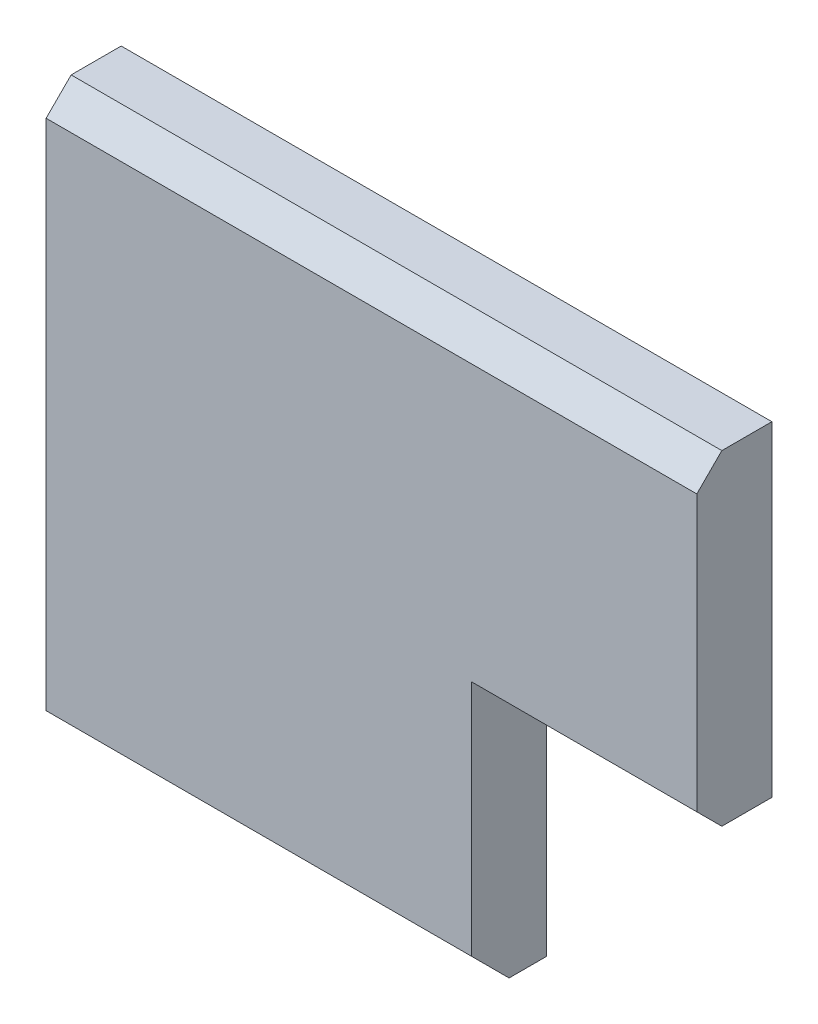
ISO-10303-21;
HEADER;
FILE_DESCRIPTION(('STEP AP214'),'2;1');
FILE_NAME('part.step','',(''),(''),'','','');
FILE_SCHEMA(('AUTOMOTIVE_DESIGN { 1 0 10303 214 1 1 1 1 }'));
ENDSEC;
DATA;
#1=APPLICATION_CONTEXT('core data for automotive mechanical design processes');
#2=APPLICATION_PROTOCOL_DEFINITION('international standard','automotive_design',2000,#1);
#3=PRODUCT_CONTEXT('',#1,'mechanical');
#4=PRODUCT('Part','Part','',(#3));
#5=PRODUCT_RELATED_PRODUCT_CATEGORY('part','',(#4));
#6=PRODUCT_DEFINITION_FORMATION('','',#4);
#7=PRODUCT_DEFINITION_CONTEXT('part definition',#1,'design');
#8=PRODUCT_DEFINITION('design','',#6,#7);
#9=PRODUCT_DEFINITION_SHAPE('','',#8);
#10=(LENGTH_UNIT() NAMED_UNIT(*) SI_UNIT(.MILLI.,.METRE.));
#11=(NAMED_UNIT(*) PLANE_ANGLE_UNIT() SI_UNIT($,.RADIAN.));
#12=(NAMED_UNIT(*) SI_UNIT($,.STERADIAN.) SOLID_ANGLE_UNIT());
#13=UNCERTAINTY_MEASURE_WITH_UNIT(LENGTH_MEASURE(1.E-05),#10,'distance_accuracy_value','');
#14=(GEOMETRIC_REPRESENTATION_CONTEXT(3) GLOBAL_UNCERTAINTY_ASSIGNED_CONTEXT((#13)) GLOBAL_UNIT_ASSIGNED_CONTEXT((#10,
#11,#12)) REPRESENTATION_CONTEXT('',''));
#15=CARTESIAN_POINT('',(0.,0.,0.));
#16=DIRECTION('',(0.,0.,1.));
#17=DIRECTION('',(1.,0.,0.));
#18=AXIS2_PLACEMENT_3D('',#15,#16,#17);
#19=CARTESIAN_POINT('',(-13.,-10.,3.));
#20=DIRECTION('',(1.,0.,0.));
#21=DIRECTION('',(0.,1.,0.));
#22=AXIS2_PLACEMENT_3D('',#19,#20,#21);
#23=PLANE('',#22);
#24=DIRECTION('',(0.,-1.,0.));
#25=VECTOR('',#24,1.);
#26=CARTESIAN_POINT('',(-13.,-10.,3.));
#27=LINE('',#26,#25);
#28=CARTESIAN_POINT('',(-13.,12.,3.));
#29=VERTEX_POINT('',#28);
#30=CARTESIAN_POINT('',(-13.,-8.50000000000001,3.));
#31=VERTEX_POINT('',#30);
#32=EDGE_CURVE('E167',#29,#31,#27,.T.);
#33=ORIENTED_EDGE('',*,*,#32,.F.);
#34=DIRECTION('',(0.,-0.707106781186546,0.707106781186549));
#35=VECTOR('',#34,1.);
#36=CARTESIAN_POINT('',(-13.,12.,3.));
#37=LINE('',#36,#35);
#38=CARTESIAN_POINT('',(-13.,13.,2.));
#39=VERTEX_POINT('',#38);
#40=EDGE_CURVE('E47',#29,#39,#37,.F.);
#41=ORIENTED_EDGE('',*,*,#40,.T.);
#42=DIRECTION('',(0.,0.,-1.));
#43=VECTOR('',#42,1.);
#44=CARTESIAN_POINT('',(-13.,13.,3.));
#45=LINE('',#44,#43);
#46=CARTESIAN_POINT('',(-13.,13.,0.));
#47=VERTEX_POINT('',#46);
#48=EDGE_CURVE('E152',#39,#47,#45,.T.);
#49=ORIENTED_EDGE('',*,*,#48,.T.);
#50=DIRECTION('',(0.,-1.,0.));
#51=VECTOR('',#50,1.);
#52=CARTESIAN_POINT('',(-13.,-10.,0.));
#53=LINE('',#52,#51);
#54=CARTESIAN_POINT('',(-13.,-10.,0.));
#55=VERTEX_POINT('',#54);
#56=EDGE_CURVE('E176',#47,#55,#53,.T.);
#57=ORIENTED_EDGE('',*,*,#56,.T.);
#58=DIRECTION('',(0.,0.,-1.));
#59=VECTOR('',#58,1.);
#60=CARTESIAN_POINT('',(-13.,-10.,3.));
#61=LINE('',#60,#59);
#62=CARTESIAN_POINT('',(-13.,-10.,1.50000000000001));
#63=VERTEX_POINT('',#62);
#64=EDGE_CURVE('E162',#63,#55,#61,.T.);
#65=ORIENTED_EDGE('',*,*,#64,.F.);
#66=DIRECTION('',(0.,-0.707106781186547,-0.707106781186548));
#67=VECTOR('',#66,1.);
#68=CARTESIAN_POINT('',(-13.,-8.50000000000001,3.));
#69=LINE('',#68,#67);
#70=EDGE_CURVE('E112',#63,#31,#69,.F.);
#71=ORIENTED_EDGE('',*,*,#70,.T.);
#72=EDGE_LOOP('',(#33,#41,#49,#57,#65,#71));
#73=FACE_BOUND('',#72,.T.);
#74=ADVANCED_FACE('F32',(#73),#23,.F.);
#75=CARTESIAN_POINT('',(13.,-10.,3.));
#76=DIRECTION('',(0.,1.,0.));
#77=DIRECTION('',(-1.,0.,0.));
#78=AXIS2_PLACEMENT_3D('',#75,#76,#77);
#79=PLANE('',#78);
#80=DIRECTION('',(1.,0.,0.));
#81=VECTOR('',#80,1.);
#82=CARTESIAN_POINT('',(13.,-10.,0.));
#83=LINE('',#82,#81);
#84=CARTESIAN_POINT('',(4.00000000000001,-10.,0.));
#85=VERTEX_POINT('',#84);
#86=EDGE_CURVE('E122',#55,#85,#83,.T.);
#87=ORIENTED_EDGE('',*,*,#86,.T.);
#88=DIRECTION('',(0.,0.,1.));
#89=VECTOR('',#88,1.);
#90=CARTESIAN_POINT('',(4.00000000000001,-10.,0.));
#91=LINE('',#90,#89);
#92=CARTESIAN_POINT('',(4.00000000000001,-10.,1.5));
#93=VERTEX_POINT('',#92);
#94=EDGE_CURVE('E119',#85,#93,#91,.T.);
#95=ORIENTED_EDGE('',*,*,#94,.T.);
#96=DIRECTION('',(-1.,0.,0.));
#97=VECTOR('',#96,1.);
#98=CARTESIAN_POINT('',(13.,-10.,1.50000000000001));
#99=LINE('',#98,#97);
#100=EDGE_CURVE('E104',#93,#63,#99,.T.);
#101=ORIENTED_EDGE('',*,*,#100,.T.);
#102=ORIENTED_EDGE('',*,*,#64,.T.);
#103=EDGE_LOOP('',(#87,#95,#101,#102));
#104=FACE_BOUND('',#103,.T.);
#105=ADVANCED_FACE('F120',(#104),#79,.F.);
#106=CARTESIAN_POINT('',(13.,13.,3.));
#107=DIRECTION('',(-1.,0.,0.));
#108=DIRECTION('',(0.,-1.,0.));
#109=AXIS2_PLACEMENT_3D('',#106,#107,#108);
#110=PLANE('',#109);
#111=DIRECTION('',(0.,1.,0.));
#112=VECTOR('',#111,1.);
#113=CARTESIAN_POINT('',(13.,13.,3.));
#114=LINE('',#113,#112);
#115=CARTESIAN_POINT('',(13.,0.999999999999994,3.));
#116=VERTEX_POINT('',#115);
#117=CARTESIAN_POINT('',(13.,12.,3.));
#118=VERTEX_POINT('',#117);
#119=EDGE_CURVE('E168',#116,#118,#114,.T.);
#120=ORIENTED_EDGE('',*,*,#119,.F.);
#121=DIRECTION('',(0.,0.707106781186546,0.707106781186549));
#122=VECTOR('',#121,1.);
#123=CARTESIAN_POINT('',(13.,0.999999999999992,3.));
#124=LINE('',#123,#122);
#125=CARTESIAN_POINT('',(13.,0.,2.));
#126=VERTEX_POINT('',#125);
#127=EDGE_CURVE('E142',#116,#126,#124,.F.);
#128=ORIENTED_EDGE('',*,*,#127,.T.);
#129=DIRECTION('',(0.,0.,1.));
#130=VECTOR('',#129,1.);
#131=CARTESIAN_POINT('',(13.,0.,0.));
#132=LINE('',#131,#130);
#133=CARTESIAN_POINT('',(13.,0.,0.));
#134=VERTEX_POINT('',#133);
#135=EDGE_CURVE('E125',#134,#126,#132,.T.);
#136=ORIENTED_EDGE('',*,*,#135,.F.);
#137=DIRECTION('',(0.,1.,0.));
#138=VECTOR('',#137,1.);
#139=CARTESIAN_POINT('',(13.,13.,0.));
#140=LINE('',#139,#138);
#141=CARTESIAN_POINT('',(13.,13.,0.));
#142=VERTEX_POINT('',#141);
#143=EDGE_CURVE('E160',#134,#142,#140,.T.);
#144=ORIENTED_EDGE('',*,*,#143,.T.);
#145=DIRECTION('',(0.,0.,-1.));
#146=VECTOR('',#145,1.);
#147=CARTESIAN_POINT('',(13.,13.,3.));
#148=LINE('',#147,#146);
#149=CARTESIAN_POINT('',(13.,13.,2.));
#150=VERTEX_POINT('',#149);
#151=EDGE_CURVE('E150',#150,#142,#148,.T.);
#152=ORIENTED_EDGE('',*,*,#151,.F.);
#153=DIRECTION('',(0.,0.707106781186546,-0.707106781186549));
#154=VECTOR('',#153,1.);
#155=CARTESIAN_POINT('',(13.,12.,3.));
#156=LINE('',#155,#154);
#157=EDGE_CURVE('E140',#150,#118,#156,.F.);
#158=ORIENTED_EDGE('',*,*,#157,.T.);
#159=EDGE_LOOP('',(#120,#128,#136,#144,#152,#158));
#160=FACE_BOUND('',#159,.T.);
#161=ADVANCED_FACE('F157',(#160),#110,.F.);
#162=CARTESIAN_POINT('',(-13.,13.,3.));
#163=DIRECTION('',(0.,-1.,0.));
#164=DIRECTION('',(1.,0.,0.));
#165=AXIS2_PLACEMENT_3D('',#162,#163,#164);
#166=PLANE('',#165);
#167=ORIENTED_EDGE('',*,*,#48,.F.);
#168=DIRECTION('',(1.,0.,0.));
#169=VECTOR('',#168,1.);
#170=CARTESIAN_POINT('',(-13.,13.,2.));
#171=LINE('',#170,#169);
#172=EDGE_CURVE('E40',#39,#150,#171,.T.);
#173=ORIENTED_EDGE('',*,*,#172,.T.);
#174=ORIENTED_EDGE('',*,*,#151,.T.);
#175=DIRECTION('',(-1.,0.,0.));
#176=VECTOR('',#175,1.);
#177=CARTESIAN_POINT('',(-13.,13.,0.));
#178=LINE('',#177,#176);
#179=EDGE_CURVE('E169',#142,#47,#178,.T.);
#180=ORIENTED_EDGE('',*,*,#179,.T.);
#181=EDGE_LOOP('',(#167,#173,#174,#180));
#182=FACE_BOUND('',#181,.T.);
#183=ADVANCED_FACE('F148',(#182),#166,.F.);
#184=CARTESIAN_POINT('',(-13.,13.,3.));
#185=DIRECTION('',(0.,0.,-1.));
#186=DIRECTION('',(-1.,0.,0.));
#187=AXIS2_PLACEMENT_3D('',#184,#185,#186);
#188=PLANE('',#187);
#189=DIRECTION('',(0.,1.,0.));
#190=VECTOR('',#189,1.);
#191=CARTESIAN_POINT('',(4.00000000000001,13.,3.));
#192=LINE('',#191,#190);
#193=CARTESIAN_POINT('',(4.00000000000001,-8.50000000000001,3.));
#194=VERTEX_POINT('',#193);
#195=CARTESIAN_POINT('',(4.00000000000001,0.99999999999999,3.));
#196=VERTEX_POINT('',#195);
#197=EDGE_CURVE('E130',#194,#196,#192,.T.);
#198=ORIENTED_EDGE('',*,*,#197,.T.);
#199=DIRECTION('',(1.,0.,0.));
#200=VECTOR('',#199,1.);
#201=CARTESIAN_POINT('',(-13.,0.99999999999999,3.));
#202=LINE('',#201,#200);
#203=EDGE_CURVE('E134',#196,#116,#202,.T.);
#204=ORIENTED_EDGE('',*,*,#203,.T.);
#205=ORIENTED_EDGE('',*,*,#119,.T.);
#206=DIRECTION('',(-1.,0.,0.));
#207=VECTOR('',#206,1.);
#208=CARTESIAN_POINT('',(-13.,12.,3.));
#209=LINE('',#208,#207);
#210=EDGE_CURVE('E131',#118,#29,#209,.T.);
#211=ORIENTED_EDGE('',*,*,#210,.T.);
#212=ORIENTED_EDGE('',*,*,#32,.T.);
#213=DIRECTION('',(1.,0.,0.));
#214=VECTOR('',#213,1.);
#215=CARTESIAN_POINT('',(-13.,-8.50000000000001,3.));
#216=LINE('',#215,#214);
#217=EDGE_CURVE('E115',#31,#194,#216,.T.);
#218=ORIENTED_EDGE('',*,*,#217,.T.);
#219=EDGE_LOOP('',(#198,#204,#205,#211,#212,#218));
#220=FACE_BOUND('',#219,.T.);
#221=ADVANCED_FACE('F166',(#220),#188,.F.);
#222=CARTESIAN_POINT('',(-13.,13.,0.));
#223=DIRECTION('',(0.,0.,-1.));
#224=DIRECTION('',(-1.,0.,0.));
#225=AXIS2_PLACEMENT_3D('',#222,#223,#224);
#226=PLANE('',#225);
#227=DIRECTION('',(-1.,0.,0.));
#228=VECTOR('',#227,1.);
#229=CARTESIAN_POINT('',(13.,0.,0.));
#230=LINE('',#229,#228);
#231=CARTESIAN_POINT('',(4.00000000000001,0.,0.));
#232=VERTEX_POINT('',#231);
#233=EDGE_CURVE('E184',#134,#232,#230,.T.);
#234=ORIENTED_EDGE('',*,*,#233,.T.);
#235=DIRECTION('',(0.,-1.,0.));
#236=VECTOR('',#235,1.);
#237=CARTESIAN_POINT('',(4.00000000000001,0.,0.));
#238=LINE('',#237,#236);
#239=EDGE_CURVE('E126',#232,#85,#238,.T.);
#240=ORIENTED_EDGE('',*,*,#239,.T.);
#241=ORIENTED_EDGE('',*,*,#86,.F.);
#242=ORIENTED_EDGE('',*,*,#56,.F.);
#243=ORIENTED_EDGE('',*,*,#179,.F.);
#244=ORIENTED_EDGE('',*,*,#143,.F.);
#245=EDGE_LOOP('',(#234,#240,#241,#242,#243,#244));
#246=FACE_BOUND('',#245,.T.);
#247=ADVANCED_FACE('F195',(#246),#226,.T.);
#248=CARTESIAN_POINT('',(-13.,-8.50000000000001,3.));
#249=DIRECTION('',(0.,0.707106781186548,-0.707106781186547));
#250=DIRECTION('',(0.,0.707106781186547,0.707106781186548));
#251=AXIS2_PLACEMENT_3D('',#248,#249,#250);
#252=PLANE('',#251);
#253=DIRECTION('',(0.,0.707106781186547,0.707106781186548));
#254=VECTOR('',#253,1.);
#255=CARTESIAN_POINT('',(4.00000000000001,-8.50000000000001,3.));
#256=LINE('',#255,#254);
#257=EDGE_CURVE('E109',#194,#93,#256,.F.);
#258=ORIENTED_EDGE('',*,*,#257,.F.);
#259=ORIENTED_EDGE('',*,*,#217,.F.);
#260=ORIENTED_EDGE('',*,*,#70,.F.);
#261=ORIENTED_EDGE('',*,*,#100,.F.);
#262=EDGE_LOOP('',(#258,#259,#260,#261));
#263=FACE_BOUND('',#262,.T.);
#264=ADVANCED_FACE('F106',(#263),#252,.F.);
#265=CARTESIAN_POINT('',(13.,0.,0.));
#266=DIRECTION('',(0.,1.,0.));
#267=DIRECTION('',(0.,0.,1.));
#268=AXIS2_PLACEMENT_3D('',#265,#266,#267);
#269=PLANE('',#268);
#270=ORIENTED_EDGE('',*,*,#135,.T.);
#271=DIRECTION('',(-1.,0.,0.));
#272=VECTOR('',#271,1.);
#273=CARTESIAN_POINT('',(13.,0.,2.));
#274=LINE('',#273,#272);
#275=CARTESIAN_POINT('',(4.00000000000001,0.,2.));
#276=VERTEX_POINT('',#275);
#277=EDGE_CURVE('E55',#126,#276,#274,.T.);
#278=ORIENTED_EDGE('',*,*,#277,.T.);
#279=DIRECTION('',(0.,0.,1.));
#280=VECTOR('',#279,1.);
#281=CARTESIAN_POINT('',(4.00000000000001,0.,0.));
#282=LINE('',#281,#280);
#283=EDGE_CURVE('E186',#232,#276,#282,.T.);
#284=ORIENTED_EDGE('',*,*,#283,.F.);
#285=ORIENTED_EDGE('',*,*,#233,.F.);
#286=EDGE_LOOP('',(#270,#278,#284,#285));
#287=FACE_BOUND('',#286,.T.);
#288=ADVANCED_FACE('F190',(#287),#269,.F.);
#289=CARTESIAN_POINT('',(4.00000000000001,0.,0.));
#290=DIRECTION('',(-1.,0.,0.));
#291=DIRECTION('',(0.,-1.,0.));
#292=AXIS2_PLACEMENT_3D('',#289,#290,#291);
#293=PLANE('',#292);
#294=ORIENTED_EDGE('',*,*,#197,.F.);
#295=ORIENTED_EDGE('',*,*,#257,.T.);
#296=ORIENTED_EDGE('',*,*,#94,.F.);
#297=ORIENTED_EDGE('',*,*,#239,.F.);
#298=ORIENTED_EDGE('',*,*,#283,.T.);
#299=DIRECTION('',(0.,-0.707106781186546,-0.707106781186549));
#300=VECTOR('',#299,1.);
#301=CARTESIAN_POINT('',(4.00000000000001,-1.,0.999999999999998));
#302=LINE('',#301,#300);
#303=EDGE_CURVE('E11',#276,#196,#302,.F.);
#304=ORIENTED_EDGE('',*,*,#303,.T.);
#305=EDGE_LOOP('',(#294,#295,#296,#297,#298,#304));
#306=FACE_BOUND('',#305,.T.);
#307=ADVANCED_FACE('F129',(#306),#293,.F.);
#308=CARTESIAN_POINT('',(-13.,0.99999999999999,3.));
#309=DIRECTION('',(0.,0.707106781186549,-0.707106781186546));
#310=DIRECTION('',(0.,0.707106781186546,0.707106781186549));
#311=AXIS2_PLACEMENT_3D('',#308,#309,#310);
#312=PLANE('',#311);
#313=ORIENTED_EDGE('',*,*,#303,.F.);
#314=ORIENTED_EDGE('',*,*,#277,.F.);
#315=ORIENTED_EDGE('',*,*,#127,.F.);
#316=ORIENTED_EDGE('',*,*,#203,.F.);
#317=EDGE_LOOP('',(#313,#314,#315,#316));
#318=FACE_BOUND('',#317,.T.);
#319=ADVANCED_FACE('F188',(#318),#312,.F.);
#320=CARTESIAN_POINT('',(-13.,12.,3.));
#321=DIRECTION('',(0.,-0.707106781186549,-0.707106781186546));
#322=DIRECTION('',(0.,0.707106781186546,-0.707106781186549));
#323=AXIS2_PLACEMENT_3D('',#320,#321,#322);
#324=PLANE('',#323);
#325=ORIENTED_EDGE('',*,*,#157,.F.);
#326=ORIENTED_EDGE('',*,*,#172,.F.);
#327=ORIENTED_EDGE('',*,*,#40,.F.);
#328=ORIENTED_EDGE('',*,*,#210,.F.);
#329=EDGE_LOOP('',(#325,#326,#327,#328));
#330=FACE_BOUND('',#329,.T.);
#331=ADVANCED_FACE('F34',(#330),#324,.F.);
#332=CLOSED_SHELL('',(#74,#105,#161,#183,#221,#247,#264,#288,#307,#319,#331));
#333=MANIFOLD_SOLID_BREP('B2',#332);
#334=ADVANCED_BREP_SHAPE_REPRESENTATION('',(#18,#333),#14);
#335=SHAPE_DEFINITION_REPRESENTATION(#9,#334);
ENDSEC;
END-ISO-10303-21;
